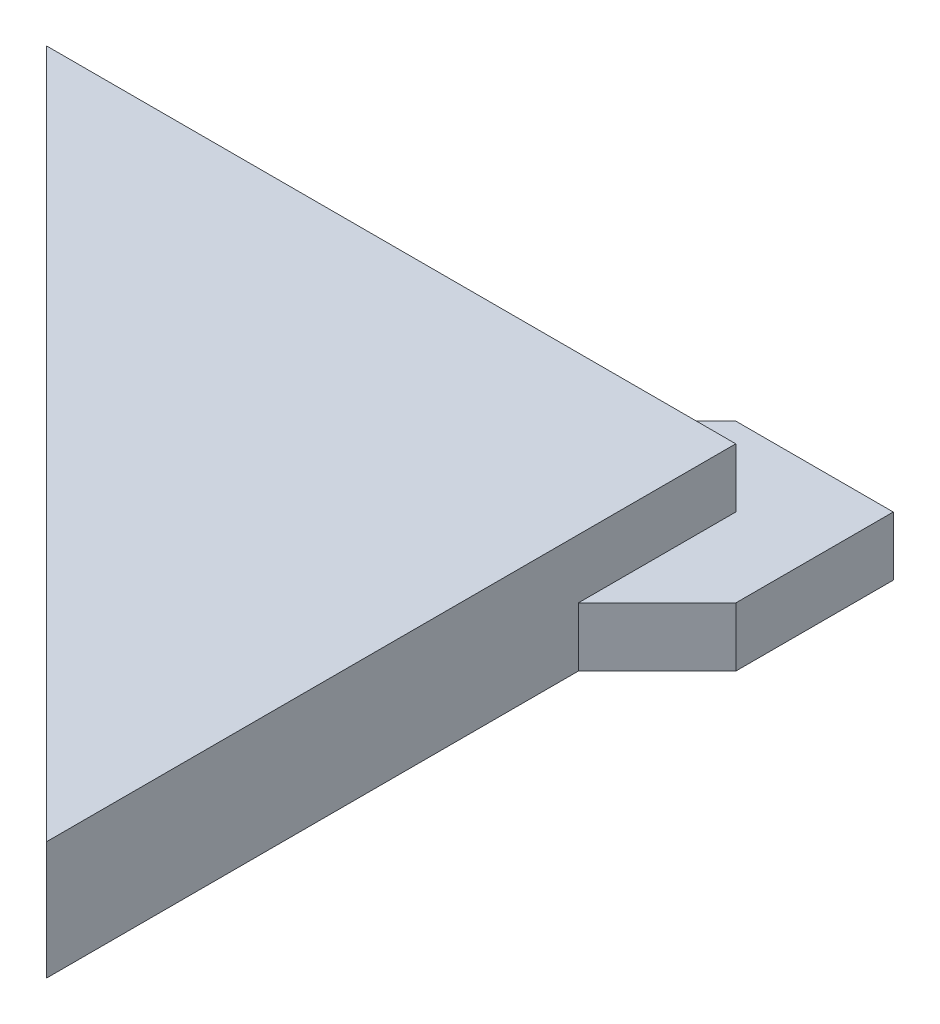
ISO-10303-21;
HEADER;
FILE_DESCRIPTION(('STEP AP214'),'2;1');
FILE_NAME('part.step','',(''),(''),'','','');
FILE_SCHEMA(('AUTOMOTIVE_DESIGN { 1 0 10303 214 1 1 1 1 }'));
ENDSEC;
DATA;
#1=APPLICATION_CONTEXT('core data for automotive mechanical design processes');
#2=APPLICATION_PROTOCOL_DEFINITION('international standard','automotive_design',2000,#1);
#3=PRODUCT_CONTEXT('',#1,'mechanical');
#4=PRODUCT('Part','Part','',(#3));
#5=PRODUCT_RELATED_PRODUCT_CATEGORY('part','',(#4));
#6=PRODUCT_DEFINITION_FORMATION('','',#4);
#7=PRODUCT_DEFINITION_CONTEXT('part definition',#1,'design');
#8=PRODUCT_DEFINITION('design','',#6,#7);
#9=PRODUCT_DEFINITION_SHAPE('','',#8);
#10=(LENGTH_UNIT() NAMED_UNIT(*) SI_UNIT(.MILLI.,.METRE.));
#11=(NAMED_UNIT(*) PLANE_ANGLE_UNIT() SI_UNIT($,.RADIAN.));
#12=(NAMED_UNIT(*) SI_UNIT($,.STERADIAN.) SOLID_ANGLE_UNIT());
#13=UNCERTAINTY_MEASURE_WITH_UNIT(LENGTH_MEASURE(1.E-05),#10,'distance_accuracy_value','');
#14=(GEOMETRIC_REPRESENTATION_CONTEXT(3) GLOBAL_UNCERTAINTY_ASSIGNED_CONTEXT((#13)) GLOBAL_UNIT_ASSIGNED_CONTEXT((#10,
#11,#12)) REPRESENTATION_CONTEXT('',''));
#15=CARTESIAN_POINT('',(0.,0.,0.));
#16=DIRECTION('',(0.,0.,1.));
#17=DIRECTION('',(1.,0.,0.));
#18=AXIS2_PLACEMENT_3D('',#15,#16,#17);
#19=CARTESIAN_POINT('',(0.,6.,-35.));
#20=DIRECTION('',(0.,0.,1.));
#21=DIRECTION('',(1.,0.,0.));
#22=AXIS2_PLACEMENT_3D('',#19,#20,#21);
#23=PLANE('',#22);
#24=DIRECTION('',(-1.,0.,0.));
#25=VECTOR('',#24,1.);
#26=CARTESIAN_POINT('',(0.,3.,-35.));
#27=LINE('',#26,#25);
#28=CARTESIAN_POINT('',(0.,3.,-35.));
#29=VERTEX_POINT('',#28);
#30=CARTESIAN_POINT('',(-7.99999999999999,3.,-35.));
#31=VERTEX_POINT('',#30);
#32=EDGE_CURVE('E49',#29,#31,#27,.T.);
#33=ORIENTED_EDGE('',*,*,#32,.T.);
#34=DIRECTION('',(0.,-1.,0.));
#35=VECTOR('',#34,1.);
#36=CARTESIAN_POINT('',(-7.99999999999999,3.,-35.));
#37=LINE('',#36,#35);
#38=CARTESIAN_POINT('',(-7.99999999999999,0.,-35.));
#39=VERTEX_POINT('',#38);
#40=EDGE_CURVE('E141',#31,#39,#37,.T.);
#41=ORIENTED_EDGE('',*,*,#40,.T.);
#42=DIRECTION('',(-1.,0.,0.));
#43=VECTOR('',#42,1.);
#44=CARTESIAN_POINT('',(0.,0.,-35.));
#45=LINE('',#44,#43);
#46=CARTESIAN_POINT('',(-35.,0.,-35.));
#47=VERTEX_POINT('',#46);
#48=EDGE_CURVE('E110',#39,#47,#45,.T.);
#49=ORIENTED_EDGE('',*,*,#48,.T.);
#50=DIRECTION('',(0.,-1.,0.));
#51=VECTOR('',#50,1.);
#52=CARTESIAN_POINT('',(-35.,6.,-35.));
#53=LINE('',#52,#51);
#54=CARTESIAN_POINT('',(-35.,6.,-35.));
#55=VERTEX_POINT('',#54);
#56=EDGE_CURVE('E11',#55,#47,#53,.T.);
#57=ORIENTED_EDGE('',*,*,#56,.F.);
#58=DIRECTION('',(-1.,0.,0.));
#59=VECTOR('',#58,1.);
#60=CARTESIAN_POINT('',(0.,6.,-35.));
#61=LINE('',#60,#59);
#62=CARTESIAN_POINT('',(0.,6.,-35.));
#63=VERTEX_POINT('',#62);
#64=EDGE_CURVE('E146',#63,#55,#61,.T.);
#65=ORIENTED_EDGE('',*,*,#64,.F.);
#66=DIRECTION('',(0.,-1.,0.));
#67=VECTOR('',#66,1.);
#68=CARTESIAN_POINT('',(0.,6.,-35.));
#69=LINE('',#68,#67);
#70=EDGE_CURVE('E154',#63,#29,#69,.T.);
#71=ORIENTED_EDGE('',*,*,#70,.T.);
#72=EDGE_LOOP('',(#33,#41,#49,#57,#65,#71));
#73=FACE_BOUND('',#72,.T.);
#74=ADVANCED_FACE('F35',(#73),#23,.F.);
#75=CARTESIAN_POINT('',(0.,6.,0.));
#76=DIRECTION('',(0.707106781186547,0.,-0.707106781186548));
#77=DIRECTION('',(-0.707106781186548,0.,-0.707106781186547));
#78=AXIS2_PLACEMENT_3D('',#75,#76,#77);
#79=PLANE('',#78);
#80=DIRECTION('',(0.707106781186548,0.,0.707106781186547));
#81=VECTOR('',#80,1.);
#82=CARTESIAN_POINT('',(0.,0.,0.));
#83=LINE('',#82,#81);
#84=CARTESIAN_POINT('',(0.,0.,0.));
#85=VERTEX_POINT('',#84);
#86=EDGE_CURVE('E156',#47,#85,#83,.T.);
#87=ORIENTED_EDGE('',*,*,#86,.T.);
#88=DIRECTION('',(0.,-1.,0.));
#89=VECTOR('',#88,1.);
#90=CARTESIAN_POINT('',(0.,6.,0.));
#91=LINE('',#90,#89);
#92=CARTESIAN_POINT('',(0.,6.,0.));
#93=VERTEX_POINT('',#92);
#94=EDGE_CURVE('E42',#93,#85,#91,.T.);
#95=ORIENTED_EDGE('',*,*,#94,.F.);
#96=DIRECTION('',(0.707106781186548,0.,0.707106781186547));
#97=VECTOR('',#96,1.);
#98=CARTESIAN_POINT('',(0.,6.,0.));
#99=LINE('',#98,#97);
#100=EDGE_CURVE('E149',#55,#93,#99,.T.);
#101=ORIENTED_EDGE('',*,*,#100,.F.);
#102=ORIENTED_EDGE('',*,*,#56,.T.);
#103=EDGE_LOOP('',(#87,#95,#101,#102));
#104=FACE_BOUND('',#103,.T.);
#105=ADVANCED_FACE('F179',(#104),#79,.F.);
#106=CARTESIAN_POINT('',(0.,6.,0.));
#107=DIRECTION('',(-1.,0.,0.));
#108=DIRECTION('',(0.,0.,1.));
#109=AXIS2_PLACEMENT_3D('',#106,#107,#108);
#110=PLANE('',#109);
#111=DIRECTION('',(0.,0.,-1.));
#112=VECTOR('',#111,1.);
#113=CARTESIAN_POINT('',(0.,0.,0.));
#114=LINE('',#113,#112);
#115=CARTESIAN_POINT('',(0.,0.,-27.));
#116=VERTEX_POINT('',#115);
#117=EDGE_CURVE('E150',#85,#116,#114,.T.);
#118=ORIENTED_EDGE('',*,*,#117,.T.);
#119=DIRECTION('',(0.,-1.,0.));
#120=VECTOR('',#119,1.);
#121=CARTESIAN_POINT('',(0.,3.,-27.));
#122=LINE('',#121,#120);
#123=CARTESIAN_POINT('',(0.,3.,-27.));
#124=VERTEX_POINT('',#123);
#125=EDGE_CURVE('E57',#124,#116,#122,.T.);
#126=ORIENTED_EDGE('',*,*,#125,.F.);
#127=DIRECTION('',(0.,0.,-1.));
#128=VECTOR('',#127,1.);
#129=CARTESIAN_POINT('',(0.,3.,0.));
#130=LINE('',#129,#128);
#131=EDGE_CURVE('E119',#124,#29,#130,.T.);
#132=ORIENTED_EDGE('',*,*,#131,.T.);
#133=ORIENTED_EDGE('',*,*,#70,.F.);
#134=DIRECTION('',(0.,0.,-1.));
#135=VECTOR('',#134,1.);
#136=CARTESIAN_POINT('',(0.,6.,0.));
#137=LINE('',#136,#135);
#138=EDGE_CURVE('E152',#93,#63,#137,.T.);
#139=ORIENTED_EDGE('',*,*,#138,.F.);
#140=ORIENTED_EDGE('',*,*,#94,.T.);
#141=EDGE_LOOP('',(#118,#126,#132,#133,#139,#140));
#142=FACE_BOUND('',#141,.T.);
#143=ADVANCED_FACE('F163',(#142),#110,.F.);
#144=CARTESIAN_POINT('',(0.,6.,0.));
#145=DIRECTION('',(0.,1.,0.));
#146=DIRECTION('',(0.,0.,1.));
#147=AXIS2_PLACEMENT_3D('',#144,#145,#146);
#148=PLANE('',#147);
#149=ORIENTED_EDGE('',*,*,#64,.T.);
#150=ORIENTED_EDGE('',*,*,#100,.T.);
#151=ORIENTED_EDGE('',*,*,#138,.T.);
#152=EDGE_LOOP('',(#149,#150,#151));
#153=FACE_BOUND('',#152,.T.);
#154=ADVANCED_FACE('F181',(#153),#148,.T.);
#155=CARTESIAN_POINT('',(0.,0.,0.));
#156=DIRECTION('',(0.,1.,0.));
#157=DIRECTION('',(0.,0.,1.));
#158=AXIS2_PLACEMENT_3D('',#155,#156,#157);
#159=PLANE('',#158);
#160=ORIENTED_EDGE('',*,*,#48,.F.);
#161=DIRECTION('',(0.707106781186547,0.,-0.707106781186548));
#162=VECTOR('',#161,1.);
#163=CARTESIAN_POINT('',(-21.5,0.,-21.5));
#164=LINE('',#163,#162);
#165=CARTESIAN_POINT('',(-4.,0.,-39.));
#166=VERTEX_POINT('',#165);
#167=EDGE_CURVE('E120',#39,#166,#164,.T.);
#168=ORIENTED_EDGE('',*,*,#167,.T.);
#169=DIRECTION('',(1.,0.,0.));
#170=VECTOR('',#169,1.);
#171=CARTESIAN_POINT('',(0.,0.,-39.));
#172=LINE('',#171,#170);
#173=CARTESIAN_POINT('',(4.,0.,-39.));
#174=VERTEX_POINT('',#173);
#175=EDGE_CURVE('E135',#166,#174,#172,.T.);
#176=ORIENTED_EDGE('',*,*,#175,.T.);
#177=DIRECTION('',(0.,0.,1.));
#178=VECTOR('',#177,1.);
#179=CARTESIAN_POINT('',(4.,0.,0.));
#180=LINE('',#179,#178);
#181=CARTESIAN_POINT('',(4.,0.,-31.));
#182=VERTEX_POINT('',#181);
#183=EDGE_CURVE('E133',#174,#182,#180,.T.);
#184=ORIENTED_EDGE('',*,*,#183,.T.);
#185=DIRECTION('',(-0.707106781186547,0.,0.707106781186548));
#186=VECTOR('',#185,1.);
#187=CARTESIAN_POINT('',(-13.5,0.,-13.5));
#188=LINE('',#187,#186);
#189=EDGE_CURVE('E105',#182,#116,#188,.T.);
#190=ORIENTED_EDGE('',*,*,#189,.T.);
#191=ORIENTED_EDGE('',*,*,#117,.F.);
#192=ORIENTED_EDGE('',*,*,#86,.F.);
#193=EDGE_LOOP('',(#160,#168,#176,#184,#190,#191,#192));
#194=FACE_BOUND('',#193,.T.);
#195=ADVANCED_FACE('F169',(#194),#159,.F.);
#196=CARTESIAN_POINT('',(-13.5,3.,-13.5));
#197=DIRECTION('',(0.707106781186548,0.,0.707106781186547));
#198=DIRECTION('',(0.707106781186547,0.,-0.707106781186548));
#199=AXIS2_PLACEMENT_3D('',#196,#197,#198);
#200=PLANE('',#199);
#201=ORIENTED_EDGE('',*,*,#189,.F.);
#202=DIRECTION('',(0.,-1.,0.));
#203=VECTOR('',#202,1.);
#204=CARTESIAN_POINT('',(4.,3.,-31.));
#205=LINE('',#204,#203);
#206=CARTESIAN_POINT('',(4.,3.,-31.));
#207=VERTEX_POINT('',#206);
#208=EDGE_CURVE('E99',#207,#182,#205,.T.);
#209=ORIENTED_EDGE('',*,*,#208,.F.);
#210=DIRECTION('',(-0.707106781186547,0.,0.707106781186548));
#211=VECTOR('',#210,1.);
#212=CARTESIAN_POINT('',(-13.5,3.,-13.5));
#213=LINE('',#212,#211);
#214=EDGE_CURVE('E102',#207,#124,#213,.T.);
#215=ORIENTED_EDGE('',*,*,#214,.T.);
#216=ORIENTED_EDGE('',*,*,#125,.T.);
#217=EDGE_LOOP('',(#201,#209,#215,#216));
#218=FACE_BOUND('',#217,.T.);
#219=ADVANCED_FACE('F101',(#218),#200,.T.);
#220=CARTESIAN_POINT('',(4.,3.,0.));
#221=DIRECTION('',(1.,0.,0.));
#222=DIRECTION('',(0.,0.,-1.));
#223=AXIS2_PLACEMENT_3D('',#220,#221,#222);
#224=PLANE('',#223);
#225=ORIENTED_EDGE('',*,*,#183,.F.);
#226=DIRECTION('',(0.,-1.,0.));
#227=VECTOR('',#226,1.);
#228=CARTESIAN_POINT('',(4.,3.,-39.));
#229=LINE('',#228,#227);
#230=CARTESIAN_POINT('',(4.,3.,-39.));
#231=VERTEX_POINT('',#230);
#232=EDGE_CURVE('E111',#231,#174,#229,.T.);
#233=ORIENTED_EDGE('',*,*,#232,.F.);
#234=DIRECTION('',(0.,0.,1.));
#235=VECTOR('',#234,1.);
#236=CARTESIAN_POINT('',(4.,3.,0.));
#237=LINE('',#236,#235);
#238=EDGE_CURVE('E117',#231,#207,#237,.T.);
#239=ORIENTED_EDGE('',*,*,#238,.T.);
#240=ORIENTED_EDGE('',*,*,#208,.T.);
#241=EDGE_LOOP('',(#225,#233,#239,#240));
#242=FACE_BOUND('',#241,.T.);
#243=ADVANCED_FACE('F122',(#242),#224,.T.);
#244=CARTESIAN_POINT('',(0.,3.,-39.));
#245=DIRECTION('',(0.,0.,-1.));
#246=DIRECTION('',(-1.,0.,0.));
#247=AXIS2_PLACEMENT_3D('',#244,#245,#246);
#248=PLANE('',#247);
#249=ORIENTED_EDGE('',*,*,#175,.F.);
#250=DIRECTION('',(0.,-1.,0.));
#251=VECTOR('',#250,1.);
#252=CARTESIAN_POINT('',(-4.,3.,-39.));
#253=LINE('',#252,#251);
#254=CARTESIAN_POINT('',(-4.,3.,-39.));
#255=VERTEX_POINT('',#254);
#256=EDGE_CURVE('E143',#255,#166,#253,.T.);
#257=ORIENTED_EDGE('',*,*,#256,.F.);
#258=DIRECTION('',(1.,0.,0.));
#259=VECTOR('',#258,1.);
#260=CARTESIAN_POINT('',(0.,3.,-39.));
#261=LINE('',#260,#259);
#262=EDGE_CURVE('E123',#255,#231,#261,.T.);
#263=ORIENTED_EDGE('',*,*,#262,.T.);
#264=ORIENTED_EDGE('',*,*,#232,.T.);
#265=EDGE_LOOP('',(#249,#257,#263,#264));
#266=FACE_BOUND('',#265,.T.);
#267=ADVANCED_FACE('F173',(#266),#248,.T.);
#268=CARTESIAN_POINT('',(-21.5,3.,-21.5));
#269=DIRECTION('',(-0.707106781186548,0.,-0.707106781186547));
#270=DIRECTION('',(-0.707106781186547,0.,0.707106781186548));
#271=AXIS2_PLACEMENT_3D('',#268,#269,#270);
#272=PLANE('',#271);
#273=ORIENTED_EDGE('',*,*,#167,.F.);
#274=ORIENTED_EDGE('',*,*,#40,.F.);
#275=DIRECTION('',(0.707106781186547,0.,-0.707106781186548));
#276=VECTOR('',#275,1.);
#277=CARTESIAN_POINT('',(-21.5,3.,-21.5));
#278=LINE('',#277,#276);
#279=EDGE_CURVE('E125',#31,#255,#278,.T.);
#280=ORIENTED_EDGE('',*,*,#279,.T.);
#281=ORIENTED_EDGE('',*,*,#256,.T.);
#282=EDGE_LOOP('',(#273,#274,#280,#281));
#283=FACE_BOUND('',#282,.T.);
#284=ADVANCED_FACE('F176',(#283),#272,.T.);
#285=CARTESIAN_POINT('',(0.,3.,0.));
#286=DIRECTION('',(0.,1.,0.));
#287=DIRECTION('',(0.,0.,1.));
#288=AXIS2_PLACEMENT_3D('',#285,#286,#287);
#289=PLANE('',#288);
#290=ORIENTED_EDGE('',*,*,#214,.F.);
#291=ORIENTED_EDGE('',*,*,#238,.F.);
#292=ORIENTED_EDGE('',*,*,#262,.F.);
#293=ORIENTED_EDGE('',*,*,#279,.F.);
#294=ORIENTED_EDGE('',*,*,#32,.F.);
#295=ORIENTED_EDGE('',*,*,#131,.F.);
#296=EDGE_LOOP('',(#290,#291,#292,#293,#294,#295));
#297=FACE_BOUND('',#296,.T.);
#298=ADVANCED_FACE('F115',(#297),#289,.T.);
#299=CLOSED_SHELL('',(#74,#105,#143,#154,#195,#219,#243,#267,#284,#298));
#300=MANIFOLD_SOLID_BREP('B2',#299);
#301=ADVANCED_BREP_SHAPE_REPRESENTATION('',(#18,#300),#14);
#302=SHAPE_DEFINITION_REPRESENTATION(#9,#301);
ENDSEC;
END-ISO-10303-21;
